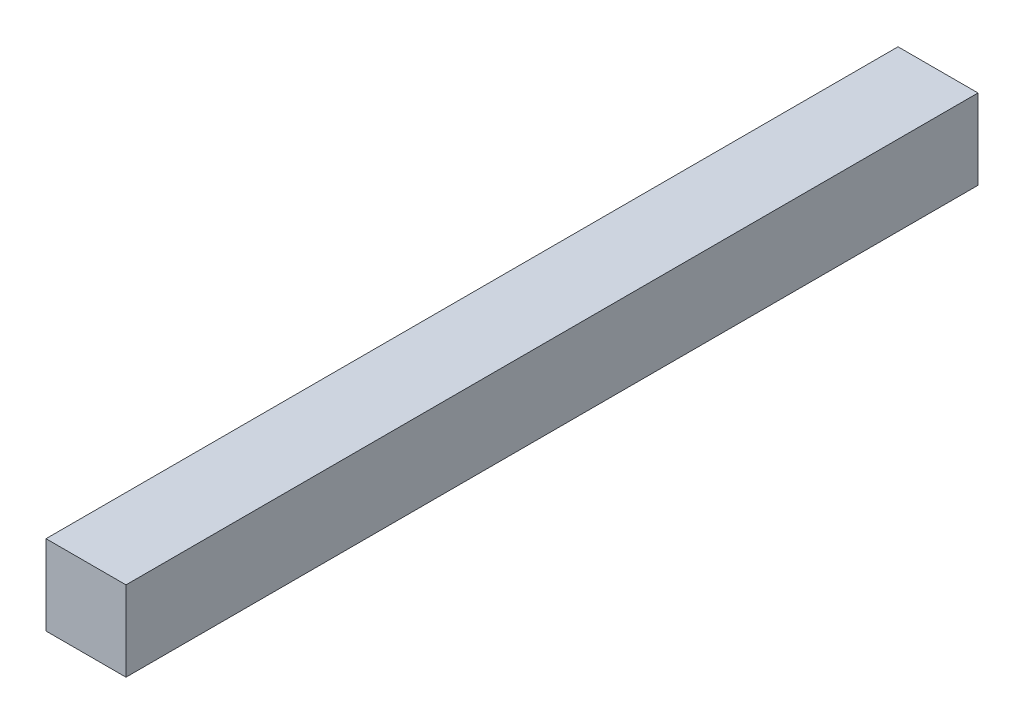
ISO-10303-21;
HEADER;
FILE_DESCRIPTION(('STEP AP214'),'2;1');
FILE_NAME('part.step','',(''),(''),'','','');
FILE_SCHEMA(('AUTOMOTIVE_DESIGN { 1 0 10303 214 1 1 1 1 }'));
ENDSEC;
DATA;
#1=APPLICATION_CONTEXT('core data for automotive mechanical design processes');
#2=APPLICATION_PROTOCOL_DEFINITION('international standard','automotive_design',2000,#1);
#3=PRODUCT_CONTEXT('',#1,'mechanical');
#4=PRODUCT('Part','Part','',(#3));
#5=PRODUCT_RELATED_PRODUCT_CATEGORY('part','',(#4));
#6=PRODUCT_DEFINITION_FORMATION('','',#4);
#7=PRODUCT_DEFINITION_CONTEXT('part definition',#1,'design');
#8=PRODUCT_DEFINITION('design','',#6,#7);
#9=PRODUCT_DEFINITION_SHAPE('','',#8);
#10=(LENGTH_UNIT() NAMED_UNIT(*) SI_UNIT(.MILLI.,.METRE.));
#11=(NAMED_UNIT(*) PLANE_ANGLE_UNIT() SI_UNIT($,.RADIAN.));
#12=(NAMED_UNIT(*) SI_UNIT($,.STERADIAN.) SOLID_ANGLE_UNIT());
#13=UNCERTAINTY_MEASURE_WITH_UNIT(LENGTH_MEASURE(1.E-05),#10,'distance_accuracy_value','');
#14=(GEOMETRIC_REPRESENTATION_CONTEXT(3) GLOBAL_UNCERTAINTY_ASSIGNED_CONTEXT((#13)) GLOBAL_UNIT_ASSIGNED_CONTEXT((#10,
#11,#12)) REPRESENTATION_CONTEXT('',''));
#15=CARTESIAN_POINT('',(0.,0.,0.));
#16=DIRECTION('',(0.,0.,1.));
#17=DIRECTION('',(1.,0.,0.));
#18=AXIS2_PLACEMENT_3D('',#15,#16,#17);
#19=CARTESIAN_POINT('',(0.009999980000003,0.009999980000003,0.));
#20=DIRECTION('',(1.,0.,0.));
#21=DIRECTION('',(0.,0.,-1.));
#22=AXIS2_PLACEMENT_3D('',#19,#20,#21);
#23=PLANE('',#22);
#24=DIRECTION('',(0.,0.,-1.));
#25=VECTOR('',#24,1.);
#26=CARTESIAN_POINT('',(0.009999980000003,0.,0.));
#27=LINE('',#26,#25);
#28=CARTESIAN_POINT('',(0.009999980000003,0.,0.));
#29=VERTEX_POINT('',#28);
#30=CARTESIAN_POINT('',(0.009999980000003,0.,0.10651998));
#31=VERTEX_POINT('',#30);
#32=EDGE_CURVE('E19',#29,#31,#27,.F.);
#33=ORIENTED_EDGE('',*,*,#32,.F.);
#34=DIRECTION('',(0.,1.,0.));
#35=VECTOR('',#34,1.);
#36=CARTESIAN_POINT('',(0.009999980000003,0.,0.));
#37=LINE('',#36,#35);
#38=CARTESIAN_POINT('',(0.009999980000003,0.009999980000003,0.));
#39=VERTEX_POINT('',#38);
#40=EDGE_CURVE('E79',#29,#39,#37,.T.);
#41=ORIENTED_EDGE('',*,*,#40,.T.);
#42=DIRECTION('',(0.,0.,1.));
#43=VECTOR('',#42,1.);
#44=CARTESIAN_POINT('',(0.009999980000003,0.009999980000003,0.));
#45=LINE('',#44,#43);
#46=CARTESIAN_POINT('',(0.009999980000003,0.009999980000003,0.10651998));
#47=VERTEX_POINT('',#46);
#48=EDGE_CURVE('E67',#47,#39,#45,.F.);
#49=ORIENTED_EDGE('',*,*,#48,.F.);
#50=DIRECTION('',(0.,1.,0.));
#51=VECTOR('',#50,1.);
#52=CARTESIAN_POINT('',(0.009999980000003,0.,0.10651998));
#53=LINE('',#52,#51);
#54=EDGE_CURVE('E55',#31,#47,#53,.T.);
#55=ORIENTED_EDGE('',*,*,#54,.F.);
#56=EDGE_LOOP('',(#33,#41,#49,#55));
#57=FACE_BOUND('',#56,.T.);
#58=ADVANCED_FACE('F16',(#57),#23,.T.);
#59=CARTESIAN_POINT('',(0.009999980000003,0.,0.));
#60=DIRECTION('',(0.,-1.,0.));
#61=DIRECTION('',(0.,0.,-1.));
#62=AXIS2_PLACEMENT_3D('',#59,#60,#61);
#63=PLANE('',#62);
#64=DIRECTION('',(0.,0.,1.));
#65=VECTOR('',#64,1.);
#66=CARTESIAN_POINT('',(0.,0.,0.));
#67=LINE('',#66,#65);
#68=CARTESIAN_POINT('',(0.,0.,0.));
#69=VERTEX_POINT('',#68);
#70=CARTESIAN_POINT('',(0.,0.,0.10651998));
#71=VERTEX_POINT('',#70);
#72=EDGE_CURVE('E82',#69,#71,#67,.T.);
#73=ORIENTED_EDGE('',*,*,#72,.F.);
#74=DIRECTION('',(1.,0.,0.));
#75=VECTOR('',#74,1.);
#76=CARTESIAN_POINT('',(0.,0.,0.));
#77=LINE('',#76,#75);
#78=EDGE_CURVE('E64',#69,#29,#77,.T.);
#79=ORIENTED_EDGE('',*,*,#78,.T.);
#80=ORIENTED_EDGE('',*,*,#32,.T.);
#81=DIRECTION('',(1.,0.,0.));
#82=VECTOR('',#81,1.);
#83=CARTESIAN_POINT('',(0.,0.,0.10651998));
#84=LINE('',#83,#82);
#85=EDGE_CURVE('E61',#71,#31,#84,.T.);
#86=ORIENTED_EDGE('',*,*,#85,.F.);
#87=EDGE_LOOP('',(#73,#79,#80,#86));
#88=FACE_BOUND('',#87,.T.);
#89=ADVANCED_FACE('F60',(#88),#63,.T.);
#90=CARTESIAN_POINT('',(0.,0.,0.10651998));
#91=DIRECTION('',(0.,0.,1.));
#92=DIRECTION('',(1.,0.,0.));
#93=AXIS2_PLACEMENT_3D('',#90,#91,#92);
#94=PLANE('',#93);
#95=DIRECTION('',(1.,0.,0.));
#96=VECTOR('',#95,1.);
#97=CARTESIAN_POINT('',(0.,0.009999980000003,0.10651998));
#98=LINE('',#97,#96);
#99=CARTESIAN_POINT('',(0.,0.009999980000003,0.10651998));
#100=VERTEX_POINT('',#99);
#101=EDGE_CURVE('E69',#100,#47,#98,.T.);
#102=ORIENTED_EDGE('',*,*,#101,.F.);
#103=DIRECTION('',(0.,1.,0.));
#104=VECTOR('',#103,1.);
#105=CARTESIAN_POINT('',(0.,0.,0.10651998));
#106=LINE('',#105,#104);
#107=EDGE_CURVE('E73',#71,#100,#106,.T.);
#108=ORIENTED_EDGE('',*,*,#107,.F.);
#109=ORIENTED_EDGE('',*,*,#85,.T.);
#110=ORIENTED_EDGE('',*,*,#54,.T.);
#111=EDGE_LOOP('',(#102,#108,#109,#110));
#112=FACE_BOUND('',#111,.T.);
#113=ADVANCED_FACE('F71',(#112),#94,.T.);
#114=CARTESIAN_POINT('',(0.,0.009999980000003,0.));
#115=DIRECTION('',(0.,1.,0.));
#116=DIRECTION('',(0.,0.,1.));
#117=AXIS2_PLACEMENT_3D('',#114,#115,#116);
#118=PLANE('',#117);
#119=ORIENTED_EDGE('',*,*,#48,.T.);
#120=DIRECTION('',(1.,0.,0.));
#121=VECTOR('',#120,1.);
#122=CARTESIAN_POINT('',(0.,0.009999980000003,0.));
#123=LINE('',#122,#121);
#124=CARTESIAN_POINT('',(0.,0.009999980000003,0.));
#125=VERTEX_POINT('',#124);
#126=EDGE_CURVE('E34',#39,#125,#123,.F.);
#127=ORIENTED_EDGE('',*,*,#126,.T.);
#128=DIRECTION('',(0.,0.,1.));
#129=VECTOR('',#128,1.);
#130=CARTESIAN_POINT('',(0.,0.009999980000003,0.));
#131=LINE('',#130,#129);
#132=EDGE_CURVE('E25',#100,#125,#131,.F.);
#133=ORIENTED_EDGE('',*,*,#132,.F.);
#134=ORIENTED_EDGE('',*,*,#101,.T.);
#135=EDGE_LOOP('',(#119,#127,#133,#134));
#136=FACE_BOUND('',#135,.T.);
#137=ADVANCED_FACE('F88',(#136),#118,.T.);
#138=CARTESIAN_POINT('',(0.,0.,0.));
#139=DIRECTION('',(0.,0.,1.));
#140=DIRECTION('',(1.,0.,0.));
#141=AXIS2_PLACEMENT_3D('',#138,#139,#140);
#142=PLANE('',#141);
#143=ORIENTED_EDGE('',*,*,#126,.F.);
#144=ORIENTED_EDGE('',*,*,#40,.F.);
#145=ORIENTED_EDGE('',*,*,#78,.F.);
#146=DIRECTION('',(0.,1.,0.));
#147=VECTOR('',#146,1.);
#148=CARTESIAN_POINT('',(0.,0.,0.));
#149=LINE('',#148,#147);
#150=EDGE_CURVE('E11',#125,#69,#149,.F.);
#151=ORIENTED_EDGE('',*,*,#150,.F.);
#152=EDGE_LOOP('',(#143,#144,#145,#151));
#153=FACE_BOUND('',#152,.T.);
#154=ADVANCED_FACE('F90',(#153),#142,.F.);
#155=CARTESIAN_POINT('',(0.,0.,0.));
#156=DIRECTION('',(-1.,0.,0.));
#157=DIRECTION('',(0.,0.,1.));
#158=AXIS2_PLACEMENT_3D('',#155,#156,#157);
#159=PLANE('',#158);
#160=ORIENTED_EDGE('',*,*,#132,.T.);
#161=ORIENTED_EDGE('',*,*,#150,.T.);
#162=ORIENTED_EDGE('',*,*,#72,.T.);
#163=ORIENTED_EDGE('',*,*,#107,.T.);
#164=EDGE_LOOP('',(#160,#161,#162,#163));
#165=FACE_BOUND('',#164,.T.);
#166=ADVANCED_FACE('F87',(#165),#159,.T.);
#167=CLOSED_SHELL('',(#58,#89,#113,#137,#154,#166));
#168=MANIFOLD_SOLID_BREP('B1',#167);
#169=ADVANCED_BREP_SHAPE_REPRESENTATION('',(#18,#168),#14);
#170=SHAPE_DEFINITION_REPRESENTATION(#9,#169);
ENDSEC;
END-ISO-10303-21;
